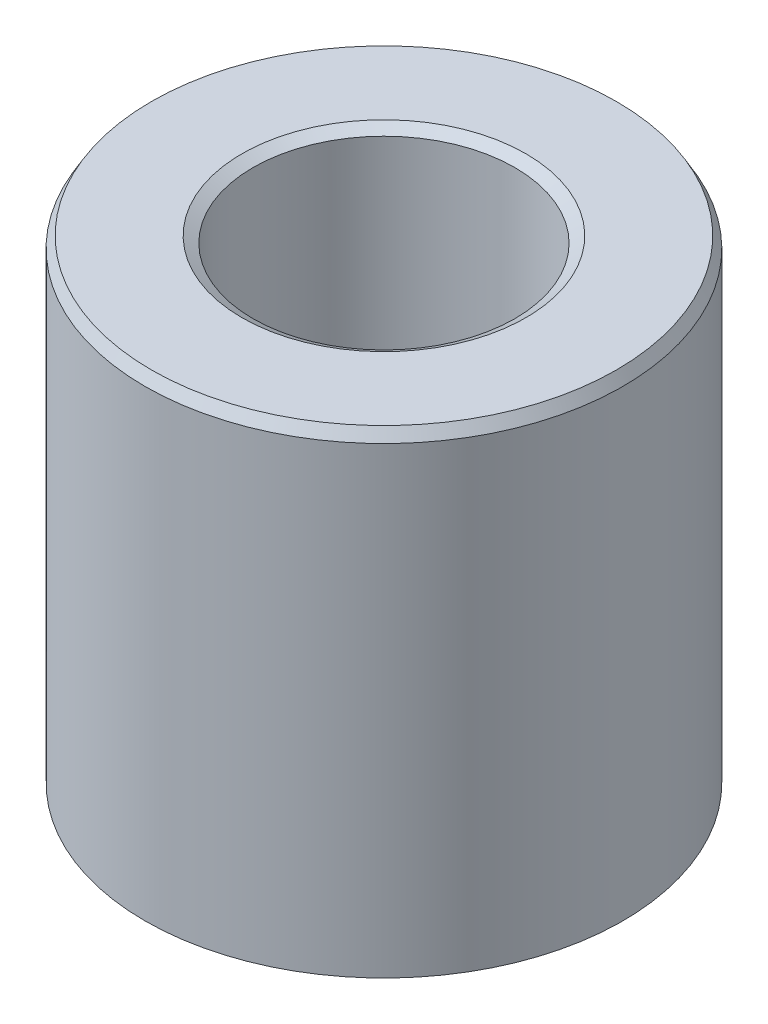
ISO-10303-21;
HEADER;
FILE_DESCRIPTION(('STEP AP214'),'2;1');
FILE_NAME('part.step','',(''),(''),'','','');
FILE_SCHEMA(('AUTOMOTIVE_DESIGN { 1 0 10303 214 1 1 1 1 }'));
ENDSEC;
DATA;
#1=APPLICATION_CONTEXT('core data for automotive mechanical design processes');
#2=APPLICATION_PROTOCOL_DEFINITION('international standard','automotive_design',2000,#1);
#3=PRODUCT_CONTEXT('',#1,'mechanical');
#4=PRODUCT('Part','Part','',(#3));
#5=PRODUCT_RELATED_PRODUCT_CATEGORY('part','',(#4));
#6=PRODUCT_DEFINITION_FORMATION('','',#4);
#7=PRODUCT_DEFINITION_CONTEXT('part definition',#1,'design');
#8=PRODUCT_DEFINITION('design','',#6,#7);
#9=PRODUCT_DEFINITION_SHAPE('','',#8);
#10=(LENGTH_UNIT() NAMED_UNIT(*) SI_UNIT(.MILLI.,.METRE.));
#11=(NAMED_UNIT(*) PLANE_ANGLE_UNIT() SI_UNIT($,.RADIAN.));
#12=(NAMED_UNIT(*) SI_UNIT($,.STERADIAN.) SOLID_ANGLE_UNIT());
#13=UNCERTAINTY_MEASURE_WITH_UNIT(LENGTH_MEASURE(1.E-05),#10,'distance_accuracy_value','');
#14=(GEOMETRIC_REPRESENTATION_CONTEXT(3) GLOBAL_UNCERTAINTY_ASSIGNED_CONTEXT((#13)) GLOBAL_UNIT_ASSIGNED_CONTEXT((#10,
#11,#12)) REPRESENTATION_CONTEXT('',''));
#15=CARTESIAN_POINT('',(0.,0.,0.));
#16=DIRECTION('',(0.,0.,1.));
#17=DIRECTION('',(1.,0.,0.));
#18=AXIS2_PLACEMENT_3D('',#15,#16,#17);
#19=CARTESIAN_POINT('',(0.,60.3174578292756,0.));
#20=DIRECTION('',(0.,-1.,0.));
#21=DIRECTION('',(0.,0.,-1.));
#22=AXIS2_PLACEMENT_3D('',#19,#20,#21);
#23=CYLINDRICAL_SURFACE('',#22,30.);
#24=CARTESIAN_POINT('',(0.,0.803389568518595,0.));
#25=DIRECTION('',(0.,1.,0.));
#26=DIRECTION('',(0.,0.,1.));
#27=AXIS2_PLACEMENT_3D('',#24,#25,#26);
#28=CIRCLE('',#27,30.);
#29=CARTESIAN_POINT('',(0.,0.803389568518595,30.));
#30=VERTEX_POINT('',#29);
#31=EDGE_CURVE('E10',#30,#30,#28,.T.);
#32=ORIENTED_EDGE('',*,*,#31,.T.);
#33=EDGE_LOOP('',(#32));
#34=FACE_BOUND('',#33,.T.);
#35=CARTESIAN_POINT('',(0.,58.9259462783306,0.));
#36=DIRECTION('',(0.,1.,0.));
#37=DIRECTION('',(0.,0.,1.));
#38=AXIS2_PLACEMENT_3D('',#35,#36,#37);
#39=CIRCLE('',#38,30.);
#40=CARTESIAN_POINT('',(0.,58.9259462783306,30.));
#41=VERTEX_POINT('',#40);
#42=EDGE_CURVE('E50',#41,#41,#39,.F.);
#43=ORIENTED_EDGE('',*,*,#42,.T.);
#44=EDGE_LOOP('',(#43));
#45=FACE_BOUND('',#44,.T.);
#46=ADVANCED_FACE('F39',(#34,#45),#23,.T.);
#47=CARTESIAN_POINT('',(0.,60.3174578292756,0.));
#48=DIRECTION('',(0.,1.,0.));
#49=DIRECTION('',(0.,0.,1.));
#50=AXIS2_PLACEMENT_3D('',#47,#48,#49);
#51=PLANE('',#50);
#52=CARTESIAN_POINT('',(0.,60.3174578292756,0.));
#53=DIRECTION('',(0.,1.,0.));
#54=DIRECTION('',(0.,0.,1.));
#55=AXIS2_PLACEMENT_3D('',#52,#53,#54);
#56=CIRCLE('',#55,17.8319004380273);
#57=CARTESIAN_POINT('',(0.,60.3174578292756,17.8319004380273));
#58=VERTEX_POINT('',#57);
#59=EDGE_CURVE('E58',#58,#58,#56,.F.);
#60=ORIENTED_EDGE('',*,*,#59,.T.);
#61=EDGE_LOOP('',(#60));
#62=FACE_BOUND('',#61,.T.);
#63=CARTESIAN_POINT('',(0.,60.3174578292756,0.));
#64=DIRECTION('',(0.,1.,0.));
#65=DIRECTION('',(0.,0.,1.));
#66=AXIS2_PLACEMENT_3D('',#63,#64,#65);
#67=CIRCLE('',#66,29.1966104314814);
#68=CARTESIAN_POINT('',(0.,60.3174578292756,29.1966104314814));
#69=VERTEX_POINT('',#68);
#70=EDGE_CURVE('E61',#69,#69,#67,.T.);
#71=ORIENTED_EDGE('',*,*,#70,.T.);
#72=EDGE_LOOP('',(#71));
#73=FACE_BOUND('',#72,.T.);
#74=ADVANCED_FACE('F88',(#62,#73),#51,.T.);
#75=CARTESIAN_POINT('',(0.,0.,0.));
#76=DIRECTION('',(0.,1.,0.));
#77=DIRECTION('',(0.,0.,1.));
#78=AXIS2_PLACEMENT_3D('',#75,#76,#77);
#79=PLANE('',#78);
#80=CARTESIAN_POINT('',(0.,0.,0.));
#81=DIRECTION('',(0.,1.,0.));
#82=DIRECTION('',(0.,0.,1.));
#83=AXIS2_PLACEMENT_3D('',#80,#81,#82);
#84=CIRCLE('',#83,17.2437784556008);
#85=CARTESIAN_POINT('',(0.,0.,-17.2437784556008));
#86=VERTEX_POINT('',#85);
#87=EDGE_CURVE('E51',#86,#86,#84,.T.);
#88=ORIENTED_EDGE('',*,*,#87,.T.);
#89=EDGE_LOOP('',(#88));
#90=FACE_BOUND('',#89,.T.);
#91=CARTESIAN_POINT('',(0.,0.,0.));
#92=DIRECTION('',(0.,1.,0.));
#93=DIRECTION('',(0.,0.,1.));
#94=AXIS2_PLACEMENT_3D('',#91,#92,#93);
#95=CIRCLE('',#94,28.6084884490549);
#96=CARTESIAN_POINT('',(0.,0.,28.6084884490549));
#97=VERTEX_POINT('',#96);
#98=EDGE_CURVE('E54',#97,#97,#95,.F.);
#99=ORIENTED_EDGE('',*,*,#98,.T.);
#100=EDGE_LOOP('',(#99));
#101=FACE_BOUND('',#100,.T.);
#102=ADVANCED_FACE('F83',(#90,#101),#79,.F.);
#103=CARTESIAN_POINT('',(0.,60.3174578292756,0.));
#104=DIRECTION('',(0.,-1.,0.));
#105=DIRECTION('',(0.,0.,-1.));
#106=AXIS2_PLACEMENT_3D('',#103,#104,#105);
#107=CYLINDRICAL_SURFACE('',#106,16.4403888870822);
#108=CARTESIAN_POINT('',(0.,59.514068260757,0.));
#109=DIRECTION('',(0.,1.,0.));
#110=DIRECTION('',(0.,0.,1.));
#111=AXIS2_PLACEMENT_3D('',#108,#109,#110);
#112=CIRCLE('',#111,16.4403888870822);
#113=CARTESIAN_POINT('',(0.,59.514068260757,16.4403888870822));
#114=VERTEX_POINT('',#113);
#115=EDGE_CURVE('E67',#114,#114,#112,.T.);
#116=ORIENTED_EDGE('',*,*,#115,.T.);
#117=EDGE_LOOP('',(#116));
#118=FACE_BOUND('',#117,.T.);
#119=CARTESIAN_POINT('',(0.,1.39151155094504,0.));
#120=DIRECTION('',(0.,1.,0.));
#121=DIRECTION('',(0.,0.,1.));
#122=AXIS2_PLACEMENT_3D('',#119,#120,#121);
#123=CIRCLE('',#122,16.4403888870822);
#124=CARTESIAN_POINT('',(0.,1.39151155094504,-16.4403888870822));
#125=VERTEX_POINT('',#124);
#126=EDGE_CURVE('E69',#125,#125,#123,.F.);
#127=ORIENTED_EDGE('',*,*,#126,.T.);
#128=EDGE_LOOP('',(#127));
#129=FACE_BOUND('',#128,.T.);
#130=ADVANCED_FACE('F71',(#118,#129),#107,.F.);
#131=CARTESIAN_POINT('',(0.,59.514068260757,0.));
#132=DIRECTION('',(0.,1.,0.));
#133=DIRECTION('',(0.,0.,1.));
#134=AXIS2_PLACEMENT_3D('',#131,#132,#133);
#135=CONICAL_SURFACE('',#134,16.4403888870822,1.0471975511966);
#136=ORIENTED_EDGE('',*,*,#59,.F.);
#137=EDGE_LOOP('',(#136));
#138=FACE_BOUND('',#137,.T.);
#139=ORIENTED_EDGE('',*,*,#115,.F.);
#140=EDGE_LOOP('',(#139));
#141=FACE_BOUND('',#140,.T.);
#142=ADVANCED_FACE('F77',(#138,#141),#135,.F.);
#143=CARTESIAN_POINT('',(0.,0.,0.));
#144=DIRECTION('',(0.,-1.,0.));
#145=DIRECTION('',(0.,0.,-1.));
#146=AXIS2_PLACEMENT_3D('',#143,#144,#145);
#147=CONICAL_SURFACE('',#146,17.2437784556008,0.523598775598297);
#148=CARTESIAN_POINT('',(0.,1.39151155094504,-16.4403888870822));
#149=CARTESIAN_POINT('',(0.,1.37701663895603,-16.448757528421));
#150=CARTESIAN_POINT('',(0.,1.36252172696702,-16.4571261697597));
#151=CARTESIAN_POINT('',(0.,1.333531902989,-16.4738634524372));
#152=CARTESIAN_POINT('',(0.,1.31903699099999,-16.4822320937759));
#153=CARTESIAN_POINT('',(0.,1.29004716702197,-16.4989693764534));
#154=CARTESIAN_POINT('',(0.,1.27555225503296,-16.5073380177921));
#155=CARTESIAN_POINT('',(0.,1.24656243105494,-16.5240753004696));
#156=CARTESIAN_POINT('',(0.,1.23206751906592,-16.5324439418083));
#157=CARTESIAN_POINT('',(0.,1.2030776950879,-16.5491812244858));
#158=CARTESIAN_POINT('',(0.,1.18858278309889,-16.5575498658245));
#159=CARTESIAN_POINT('',(0.,1.15959295912087,-16.574287148502));
#160=CARTESIAN_POINT('',(0.,1.14509804713186,-16.5826557898407));
#161=CARTESIAN_POINT('',(0.,1.11610822315384,-16.5993930725182));
#162=CARTESIAN_POINT('',(0.,1.10161331116483,-16.6077617138569));
#163=CARTESIAN_POINT('',(0.,1.0726234871868,-16.6244989965344));
#164=CARTESIAN_POINT('',(0.,1.05812857519779,-16.6328676378731));
#165=CARTESIAN_POINT('',(0.,1.02913875121977,-16.6496049205506));
#166=CARTESIAN_POINT('',(0.,1.01464383923076,-16.6579735618893));
#167=CARTESIAN_POINT('',(0.,0.985654015252739,-16.6747108445668));
#168=CARTESIAN_POINT('',(0.,0.971159103263729,-16.6830794859055));
#169=CARTESIAN_POINT('',(0.,0.942169279285707,-16.699816768583));
#170=CARTESIAN_POINT('',(0.,0.927674367296697,-16.7081854099217));
#171=CARTESIAN_POINT('',(0.,0.898684543318675,-16.7249226925992));
#172=CARTESIAN_POINT('',(0.,0.884189631329664,-16.733291333938));
#173=CARTESIAN_POINT('',(0.,0.855199807351642,-16.7500286166154));
#174=CARTESIAN_POINT('',(0.,0.840704895362631,-16.7583972579542));
#175=CARTESIAN_POINT('',(0.,0.811715071384609,-16.7751345406316));
#176=CARTESIAN_POINT('',(0.,0.797220159395598,-16.7835031819704));
#177=CARTESIAN_POINT('',(0.,0.768230335417577,-16.8002404646478));
#178=CARTESIAN_POINT('',(0.,0.753735423428566,-16.8086091059866));
#179=CARTESIAN_POINT('',(0.,0.724745599450544,-16.825346388664));
#180=CARTESIAN_POINT('',(0.,0.710250687461533,-16.8337150300028));
#181=CARTESIAN_POINT('',(0.,0.681260863483511,-16.8504523126802));
#182=CARTESIAN_POINT('',(0.,0.666765951494501,-16.858820954019));
#183=CARTESIAN_POINT('',(0.,0.637776127516479,-16.8755582366965));
#184=CARTESIAN_POINT('',(0.,0.623281215527468,-16.8839268780352));
#185=CARTESIAN_POINT('',(0.,0.594291391549446,-16.9006641607127));
#186=CARTESIAN_POINT('',(0.,0.579796479560435,-16.9090328020514));
#187=CARTESIAN_POINT('',(0.,0.550806655582414,-16.9257700847289));
#188=CARTESIAN_POINT('',(0.,0.536311743593403,-16.9341387260676));
#189=CARTESIAN_POINT('',(0.,0.507321919615381,-16.9508760087451));
#190=CARTESIAN_POINT('',(0.,0.49282700762637,-16.9592446500838));
#191=CARTESIAN_POINT('',(0.,0.463837183648348,-16.9759819327613));
#192=CARTESIAN_POINT('',(0.,0.449342271659337,-16.9843505741));
#193=CARTESIAN_POINT('',(0.,0.420352447681316,-17.0010878567775));
#194=CARTESIAN_POINT('',(0.,0.405857535692305,-17.0094564981162));
#195=CARTESIAN_POINT('',(0.,0.376867711714283,-17.0261937807937));
#196=CARTESIAN_POINT('',(0.,0.362372799725272,-17.0345624221324));
#197=CARTESIAN_POINT('',(0.,0.33338297574725,-17.0512997048099));
#198=CARTESIAN_POINT('',(0.,0.318888063758239,-17.0596683461486));
#199=CARTESIAN_POINT('',(0.,0.289898239780218,-17.0764056288261));
#200=CARTESIAN_POINT('',(0.,0.275403327791207,-17.0847742701648));
#201=CARTESIAN_POINT('',(0.,0.246413503813185,-17.1015115528423));
#202=CARTESIAN_POINT('',(0.,0.231918591824174,-17.109880194181));
#203=CARTESIAN_POINT('',(0.,0.202928767846152,-17.1266174768585));
#204=CARTESIAN_POINT('',(0.,0.188433855857142,-17.1349861181972));
#205=CARTESIAN_POINT('',(0.,0.15944403187912,-17.1517234008747));
#206=CARTESIAN_POINT('',(0.,0.144949119890109,-17.1600920422135));
#207=CARTESIAN_POINT('',(0.,0.115959295912087,-17.1768293248909));
#208=CARTESIAN_POINT('',(0.,0.101464383923076,-17.1851979662297));
#209=CARTESIAN_POINT('',(0.,0.0724745599450542,-17.2019352489071));
#210=CARTESIAN_POINT('',(0.,0.0579796479560435,-17.2103038902459));
#211=CARTESIAN_POINT('',(0.,0.0289898239780222,-17.2270411729233));
#212=CARTESIAN_POINT('',(0.,0.0144949119890116,-17.2354098142621));
#213=CARTESIAN_POINT('',(0.,0.,-17.2437784556008));
#214=B_SPLINE_CURVE_WITH_KNOTS('',3,(#148,#149,#150,#151,#152,#153,#154,#155,#156,#157,#158,
#159,#160,#161,#162,#163,#164,#165,#166,#167,#168,#169,#170,#171,#172,#173,#174,#175,#176,#177,
#178,#179,#180,#181,#182,#183,#184,#185,#186,#187,#188,#189,#190,#191,#192,#193,#194,#195,#196,
#197,#198,#199,#200,#201,#202,#203,#204,#205,#206,#207,#208,#209,#210,#211,#212,#213),
.UNSPECIFIED.,.F.,.F.,(4,2,2,2,2,2,2,2,2,2,2,2,2,2,2,2,2,2,2,2,2,2,2,2,2,2,2,2,2,2,2,2,4),(0.,
0.0502118480324115,0.100423696064825,0.150635544097236,0.200847392129648,0.251059240162061,
0.301271088194473,0.351482936226884,0.401694784259297,0.451906632291709,0.502118480324121,
0.552330328356534,0.602542176388945,0.652754024421357,0.70296587245377,0.753177720486182,
0.803389568518593,0.853601416551006,0.903813264583418,0.954025112615831,1.00423696064824,
1.05444880868065,1.10466065671307,1.15487250474548,1.20508435277789,1.2552962008103,
1.30550804884272,1.35571989687513,1.40593174490754,1.45614359293995,1.50635544097236,
1.55656728900478,1.60677913703719),.UNSPECIFIED.);
#215=EDGE_CURVE('BSEAM73',#125,#86,#214,.T.);
#216=ORIENTED_EDGE('',*,*,#126,.F.);
#217=ORIENTED_EDGE('',*,*,#87,.F.);
#218=ORIENTED_EDGE('',*,*,#215,.T.);
#219=ORIENTED_EDGE('',*,*,#215,.F.);
#220=EDGE_LOOP('',(#216,#218,#217,#219));
#221=FACE_BOUND('',#220,.T.);
#222=ADVANCED_FACE('F73',(#221),#147,.F.);
#223=CARTESIAN_POINT('',(0.,0.803389568518595,0.));
#224=DIRECTION('',(0.,1.,0.));
#225=DIRECTION('',(0.,0.,1.));
#226=AXIS2_PLACEMENT_3D('',#223,#224,#225);
#227=CONICAL_SURFACE('',#226,30.,1.0471975511966);
#228=CARTESIAN_POINT('',(0.,0.,28.6084884490549));
#229=CARTESIAN_POINT('',(0.,0.00836864133873453,28.622983361044));
#230=CARTESIAN_POINT('',(0.,0.0167372826774701,28.637478273033));
#231=CARTESIAN_POINT('',(0.,0.0334745653549413,28.666468097011));
#232=CARTESIAN_POINT('',(0.,0.0418432066936769,28.680963009));
#233=CARTESIAN_POINT('',(0.,0.0585804893711477,28.709952832978));
#234=CARTESIAN_POINT('',(0.,0.0669491307098828,28.724447744967));
#235=CARTESIAN_POINT('',(0.,0.0836864133873535,28.7534375689451));
#236=CARTESIAN_POINT('',(0.,0.092055054726089,28.7679324809341));
#237=CARTESIAN_POINT('',(0.,0.10879233740356,28.7969223049121));
#238=CARTESIAN_POINT('',(0.,0.117160978742295,28.8114172169011));
#239=CARTESIAN_POINT('',(0.,0.133898261419766,28.8404070408791));
#240=CARTESIAN_POINT('',(0.,0.142266902758501,28.8549019528681));
#241=CARTESIAN_POINT('',(0.,0.159004185435972,28.8838917768462));
#242=CARTESIAN_POINT('',(0.,0.167372826774707,28.8983866888352));
#243=CARTESIAN_POINT('',(0.,0.184110109452178,28.9273765128132));
#244=CARTESIAN_POINT('',(0.,0.192478750790913,28.9418714248022));
#245=CARTESIAN_POINT('',(0.,0.209216033468384,28.9708612487802));
#246=CARTESIAN_POINT('',(0.,0.217584674807119,28.9853561607692));
#247=CARTESIAN_POINT('',(0.,0.23432195748459,29.0143459847473));
#248=CARTESIAN_POINT('',(0.,0.242690598823326,29.0288408967363));
#249=CARTESIAN_POINT('',(0.,0.259427881500796,29.0578307207143));
#250=CARTESIAN_POINT('',(0.,0.267796522839532,29.0723256327033));
#251=CARTESIAN_POINT('',(0.,0.284533805517002,29.1013154566813));
#252=CARTESIAN_POINT('',(0.,0.292902446855738,29.1158103686703));
#253=CARTESIAN_POINT('',(0.,0.309639729533208,29.1448001926484));
#254=CARTESIAN_POINT('',(0.,0.318008370871943,29.1592951046374));
#255=CARTESIAN_POINT('',(0.,0.334745653549414,29.1882849286154));
#256=CARTESIAN_POINT('',(0.,0.34311429488815,29.2027798406044));
#257=CARTESIAN_POINT('',(0.,0.359851577565621,29.2317696645824));
#258=CARTESIAN_POINT('',(0.,0.368220218904356,29.2462645765714));
#259=CARTESIAN_POINT('',(0.,0.384957501581827,29.2752544005495));
#260=CARTESIAN_POINT('',(0.,0.393326142920562,29.2897493125385));
#261=CARTESIAN_POINT('',(0.,0.410063425598033,29.3187391365165));
#262=CARTESIAN_POINT('',(0.,0.418432066936768,29.3332340485055));
#263=CARTESIAN_POINT('',(0.,0.435169349614239,29.3622238724835));
#264=CARTESIAN_POINT('',(0.,0.443537990952974,29.3767187844725));
#265=CARTESIAN_POINT('',(0.,0.460275273630445,29.4057086084505));
#266=CARTESIAN_POINT('',(0.,0.46864391496918,29.4202035204396));
#267=CARTESIAN_POINT('',(0.,0.485381197646651,29.4491933444176));
#268=CARTESIAN_POINT('',(0.,0.493749838985386,29.4636882564066));
#269=CARTESIAN_POINT('',(0.,0.510487121662857,29.4926780803846));
#270=CARTESIAN_POINT('',(0.,0.518855763001592,29.5071729923736));
#271=CARTESIAN_POINT('',(0.,0.535593045679063,29.5361628163516));
#272=CARTESIAN_POINT('',(0.,0.543961687017799,29.5506577283407));
#273=CARTESIAN_POINT('',(0.,0.56069896969527,29.5796475523187));
#274=CARTESIAN_POINT('',(0.,0.569067611034005,29.5941424643077));
#275=CARTESIAN_POINT('',(0.,0.585804893711475,29.6231322882857));
#276=CARTESIAN_POINT('',(0.,0.594173535050211,29.6376272002747));
#277=CARTESIAN_POINT('',(0.,0.610910817727681,29.6666170242527));
#278=CARTESIAN_POINT('',(0.,0.619279459066416,29.6811119362418));
#279=CARTESIAN_POINT('',(0.,0.636016741743887,29.7101017602198));
#280=CARTESIAN_POINT('',(0.,0.644385383082623,29.7245966722088));
#281=CARTESIAN_POINT('',(0.,0.661122665760094,29.7535864961868));
#282=CARTESIAN_POINT('',(0.,0.669491307098829,29.7680814081758));
#283=CARTESIAN_POINT('',(0.,0.6862285897763,29.7970712321538));
#284=CARTESIAN_POINT('',(0.,0.694597231115035,29.8115661441429));
#285=CARTESIAN_POINT('',(0.,0.711334513792506,29.8405559681209));
#286=CARTESIAN_POINT('',(0.,0.719703155131241,29.8550508801099));
#287=CARTESIAN_POINT('',(0.,0.736440437808712,29.8840407040879));
#288=CARTESIAN_POINT('',(0.,0.744809079147447,29.8985356160769));
#289=CARTESIAN_POINT('',(0.,0.761546361824918,29.9275254400549));
#290=CARTESIAN_POINT('',(0.,0.769915003163653,29.942020352044));
#291=CARTESIAN_POINT('',(0.,0.786652285841124,29.971010176022));
#292=CARTESIAN_POINT('',(0.,0.795020927179859,29.985505088011));
#293=CARTESIAN_POINT('',(0.,0.803389568518595,30.));
#294=B_SPLINE_CURVE_WITH_KNOTS('',3,(#228,#229,#230,#231,#232,#233,#234,#235,#236,#237,#238,
#239,#240,#241,#242,#243,#244,#245,#246,#247,#248,#249,#250,#251,#252,#253,#254,#255,#256,#257,
#258,#259,#260,#261,#262,#263,#264,#265,#266,#267,#268,#269,#270,#271,#272,#273,#274,#275,#276,
#277,#278,#279,#280,#281,#282,#283,#284,#285,#286,#287,#288,#289,#290,#291,#292,#293),
.UNSPECIFIED.,.F.,.F.,(4,2,2,2,2,2,2,2,2,2,2,2,2,2,2,2,2,2,2,2,2,2,2,2,2,2,2,2,2,2,2,2,4),(0.,
0.0502118480324131,0.100423696064823,0.150635544097236,0.200847392129649,0.251059240162063,
0.301271088194473,0.351482936226886,0.401694784259299,0.451906632291712,0.502118480324122,
0.552330328356536,0.602542176388949,0.652754024421362,0.702965872453772,0.753177720486185,
0.803389568518598,0.853601416551011,0.903813264583421,0.954025112615835,1.00423696064825,
1.05444880868066,1.10466065671307,1.15487250474548,1.2050843527779,1.25529620081031,
1.30550804884272,1.35571989687513,1.40593174490755,1.45614359293996,1.50635544097237,
1.55656728900478,1.6067791370372),.UNSPECIFIED.);
#295=EDGE_CURVE('BSEAM76',#97,#30,#294,.T.);
#296=ORIENTED_EDGE('',*,*,#98,.F.);
#297=ORIENTED_EDGE('',*,*,#31,.F.);
#298=ORIENTED_EDGE('',*,*,#295,.T.);
#299=ORIENTED_EDGE('',*,*,#295,.F.);
#300=EDGE_LOOP('',(#296,#298,#297,#299));
#301=FACE_BOUND('',#300,.T.);
#302=ADVANCED_FACE('F76',(#301),#227,.T.);
#303=CARTESIAN_POINT('',(0.,60.3174578292756,0.));
#304=DIRECTION('',(0.,-1.,0.));
#305=DIRECTION('',(0.,0.,-1.));
#306=AXIS2_PLACEMENT_3D('',#303,#304,#305);
#307=CONICAL_SURFACE('',#306,29.1966104314814,0.523598775598293);
#308=ORIENTED_EDGE('',*,*,#42,.F.);
#309=EDGE_LOOP('',(#308));
#310=FACE_BOUND('',#309,.T.);
#311=ORIENTED_EDGE('',*,*,#70,.F.);
#312=EDGE_LOOP('',(#311));
#313=FACE_BOUND('',#312,.T.);
#314=ADVANCED_FACE('F45',(#310,#313),#307,.T.);
#315=CLOSED_SHELL('',(#46,#74,#102,#130,#142,#222,#302,#314));
#316=MANIFOLD_SOLID_BREP('B2',#315);
#317=ADVANCED_BREP_SHAPE_REPRESENTATION('',(#18,#316),#14);
#318=SHAPE_DEFINITION_REPRESENTATION(#9,#317);
ENDSEC;
END-ISO-10303-21;
